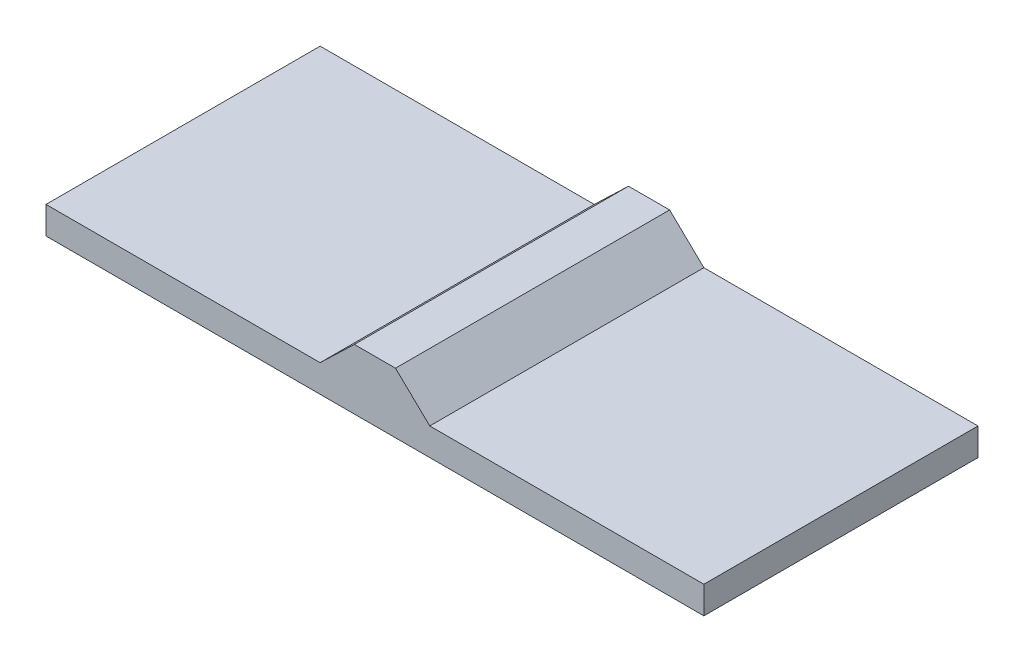
ISO-10303-21;
HEADER;
FILE_DESCRIPTION(('STEP AP214'),'2;1');
FILE_NAME('part.step','',(''),(''),'','','');
FILE_SCHEMA(('AUTOMOTIVE_DESIGN { 1 0 10303 214 1 1 1 1 }'));
ENDSEC;
DATA;
#1=APPLICATION_CONTEXT('core data for automotive mechanical design processes');
#2=APPLICATION_PROTOCOL_DEFINITION('international standard','automotive_design',2000,#1);
#3=PRODUCT_CONTEXT('',#1,'mechanical');
#4=PRODUCT('Part','Part','',(#3));
#5=PRODUCT_RELATED_PRODUCT_CATEGORY('part','',(#4));
#6=PRODUCT_DEFINITION_FORMATION('','',#4);
#7=PRODUCT_DEFINITION_CONTEXT('part definition',#1,'design');
#8=PRODUCT_DEFINITION('design','',#6,#7);
#9=PRODUCT_DEFINITION_SHAPE('','',#8);
#10=(LENGTH_UNIT() NAMED_UNIT(*) SI_UNIT(.MILLI.,.METRE.));
#11=(NAMED_UNIT(*) PLANE_ANGLE_UNIT() SI_UNIT($,.RADIAN.));
#12=(NAMED_UNIT(*) SI_UNIT($,.STERADIAN.) SOLID_ANGLE_UNIT());
#13=UNCERTAINTY_MEASURE_WITH_UNIT(LENGTH_MEASURE(1.E-05),#10,'distance_accuracy_value','');
#14=(GEOMETRIC_REPRESENTATION_CONTEXT(3) GLOBAL_UNCERTAINTY_ASSIGNED_CONTEXT((#13)) GLOBAL_UNIT_ASSIGNED_CONTEXT((#10,
#11,#12)) REPRESENTATION_CONTEXT('',''));
#15=CARTESIAN_POINT('',(0.,0.,0.));
#16=DIRECTION('',(0.,0.,1.));
#17=DIRECTION('',(1.,0.,0.));
#18=AXIS2_PLACEMENT_3D('',#15,#16,#17);
#19=CARTESIAN_POINT('',(0.,150.,0.));
#20=DIRECTION('',(0.,1.,0.));
#21=DIRECTION('',(0.,0.,1.));
#22=AXIS2_PLACEMENT_3D('',#19,#20,#21);
#23=PLANE('',#22);
#24=DIRECTION('',(-1.,0.,0.));
#25=VECTOR('',#24,1.);
#26=CARTESIAN_POINT('',(1800.,150.,-750.));
#27=LINE('',#26,#25);
#28=CARTESIAN_POINT('',(1800.,150.,-750.));
#29=VERTEX_POINT('',#28);
#30=CARTESIAN_POINT('',(300.,150.,-750.));
#31=VERTEX_POINT('',#30);
#32=EDGE_CURVE('E135',#29,#31,#27,.T.);
#33=ORIENTED_EDGE('',*,*,#32,.T.);
#34=DIRECTION('',(0.,0.,1.));
#35=VECTOR('',#34,1.);
#36=CARTESIAN_POINT('',(300.,150.,-750.));
#37=LINE('',#36,#35);
#38=CARTESIAN_POINT('',(300.,150.,750.));
#39=VERTEX_POINT('',#38);
#40=EDGE_CURVE('E128',#31,#39,#37,.T.);
#41=ORIENTED_EDGE('',*,*,#40,.T.);
#42=DIRECTION('',(1.,0.,0.));
#43=VECTOR('',#42,1.);
#44=CARTESIAN_POINT('',(1800.,150.,750.));
#45=LINE('',#44,#43);
#46=CARTESIAN_POINT('',(1800.,150.,750.));
#47=VERTEX_POINT('',#46);
#48=EDGE_CURVE('E176',#39,#47,#45,.T.);
#49=ORIENTED_EDGE('',*,*,#48,.T.);
#50=DIRECTION('',(0.,0.,-1.));
#51=VECTOR('',#50,1.);
#52=CARTESIAN_POINT('',(1800.,150.,750.));
#53=LINE('',#52,#51);
#54=EDGE_CURVE('E136',#47,#29,#53,.T.);
#55=ORIENTED_EDGE('',*,*,#54,.T.);
#56=EDGE_LOOP('',(#33,#41,#49,#55));
#57=FACE_BOUND('',#56,.T.);
#58=ADVANCED_FACE('F39',(#57),#23,.T.);
#59=CARTESIAN_POINT('',(-1800.,150.,750.));
#60=DIRECTION('',(1.,0.,0.));
#61=DIRECTION('',(0.,0.,-1.));
#62=AXIS2_PLACEMENT_3D('',#59,#60,#61);
#63=PLANE('',#62);
#64=DIRECTION('',(0.,0.,1.));
#65=VECTOR('',#64,1.);
#66=CARTESIAN_POINT('',(-1800.,0.,750.));
#67=LINE('',#66,#65);
#68=CARTESIAN_POINT('',(-1800.,0.,-750.));
#69=VERTEX_POINT('',#68);
#70=CARTESIAN_POINT('',(-1800.,0.,750.));
#71=VERTEX_POINT('',#70);
#72=EDGE_CURVE('E144',#69,#71,#67,.T.);
#73=ORIENTED_EDGE('',*,*,#72,.T.);
#74=DIRECTION('',(0.,-1.,0.));
#75=VECTOR('',#74,1.);
#76=CARTESIAN_POINT('',(-1800.,150.,750.));
#77=LINE('',#76,#75);
#78=CARTESIAN_POINT('',(-1800.,150.,750.));
#79=VERTEX_POINT('',#78);
#80=EDGE_CURVE('E11',#79,#71,#77,.T.);
#81=ORIENTED_EDGE('',*,*,#80,.F.);
#82=DIRECTION('',(0.,0.,1.));
#83=VECTOR('',#82,1.);
#84=CARTESIAN_POINT('',(-1800.,150.,750.));
#85=LINE('',#84,#83);
#86=CARTESIAN_POINT('',(-1800.,150.,-750.));
#87=VERTEX_POINT('',#86);
#88=EDGE_CURVE('E156',#87,#79,#85,.T.);
#89=ORIENTED_EDGE('',*,*,#88,.F.);
#90=DIRECTION('',(0.,-1.,0.));
#91=VECTOR('',#90,1.);
#92=CARTESIAN_POINT('',(-1800.,150.,-750.));
#93=LINE('',#92,#91);
#94=EDGE_CURVE('E132',#87,#69,#93,.T.);
#95=ORIENTED_EDGE('',*,*,#94,.T.);
#96=EDGE_LOOP('',(#73,#81,#89,#95));
#97=FACE_BOUND('',#96,.T.);
#98=ADVANCED_FACE('F41',(#97),#63,.F.);
#99=CARTESIAN_POINT('',(1800.,150.,750.));
#100=DIRECTION('',(0.,0.,-1.));
#101=DIRECTION('',(-1.,0.,0.));
#102=AXIS2_PLACEMENT_3D('',#99,#100,#101);
#103=PLANE('',#102);
#104=DIRECTION('',(1.,0.,0.));
#105=VECTOR('',#104,1.);
#106=CARTESIAN_POINT('',(1800.,0.,750.));
#107=LINE('',#106,#105);
#108=CARTESIAN_POINT('',(1800.,0.,750.));
#109=VERTEX_POINT('',#108);
#110=EDGE_CURVE('E148',#71,#109,#107,.T.);
#111=ORIENTED_EDGE('',*,*,#110,.T.);
#112=DIRECTION('',(0.,-1.,0.));
#113=VECTOR('',#112,1.);
#114=CARTESIAN_POINT('',(1800.,150.,750.));
#115=LINE('',#114,#113);
#116=EDGE_CURVE('E48',#47,#109,#115,.T.);
#117=ORIENTED_EDGE('',*,*,#116,.F.);
#118=ORIENTED_EDGE('',*,*,#48,.F.);
#119=DIRECTION('',(-0.721387321030952,0.692531828189714,0.));
#120=VECTOR('',#119,1.);
#121=CARTESIAN_POINT('',(112.5,330.,750.));
#122=LINE('',#121,#120);
#123=CARTESIAN_POINT('',(112.5,330.,750.));
#124=VERTEX_POINT('',#123);
#125=EDGE_CURVE('E55',#39,#124,#122,.T.);
#126=ORIENTED_EDGE('',*,*,#125,.T.);
#127=DIRECTION('',(-1.,0.,0.));
#128=VECTOR('',#127,1.);
#129=CARTESIAN_POINT('',(-112.5,330.,750.));
#130=LINE('',#129,#128);
#131=CARTESIAN_POINT('',(-112.5,330.,750.));
#132=VERTEX_POINT('',#131);
#133=EDGE_CURVE('E124',#124,#132,#130,.T.);
#134=ORIENTED_EDGE('',*,*,#133,.T.);
#135=DIRECTION('',(-0.721387321030952,-0.692531828189713,0.));
#136=VECTOR('',#135,1.);
#137=CARTESIAN_POINT('',(-300.,150.,750.));
#138=LINE('',#137,#136);
#139=CARTESIAN_POINT('',(-300.,150.,750.));
#140=VERTEX_POINT('',#139);
#141=EDGE_CURVE('E193',#132,#140,#138,.T.);
#142=ORIENTED_EDGE('',*,*,#141,.T.);
#143=EDGE_CURVE('E93',#79,#140,#45,.T.);
#144=ORIENTED_EDGE('',*,*,#143,.F.);
#145=ORIENTED_EDGE('',*,*,#80,.T.);
#146=EDGE_LOOP('',(#111,#117,#118,#126,#134,#142,#144,#145));
#147=FACE_BOUND('',#146,.T.);
#148=ADVANCED_FACE('F206',(#147),#103,.F.);
#149=CARTESIAN_POINT('',(1800.,150.,750.));
#150=DIRECTION('',(-1.,0.,0.));
#151=DIRECTION('',(0.,0.,1.));
#152=AXIS2_PLACEMENT_3D('',#149,#150,#151);
#153=PLANE('',#152);
#154=DIRECTION('',(0.,0.,-1.));
#155=VECTOR('',#154,1.);
#156=CARTESIAN_POINT('',(1800.,0.,750.));
#157=LINE('',#156,#155);
#158=CARTESIAN_POINT('',(1800.,0.,-750.));
#159=VERTEX_POINT('',#158);
#160=EDGE_CURVE('E151',#109,#159,#157,.T.);
#161=ORIENTED_EDGE('',*,*,#160,.T.);
#162=DIRECTION('',(0.,-1.,0.));
#163=VECTOR('',#162,1.);
#164=CARTESIAN_POINT('',(1800.,150.,-750.));
#165=LINE('',#164,#163);
#166=EDGE_CURVE('E159',#29,#159,#165,.T.);
#167=ORIENTED_EDGE('',*,*,#166,.F.);
#168=ORIENTED_EDGE('',*,*,#54,.F.);
#169=ORIENTED_EDGE('',*,*,#116,.T.);
#170=EDGE_LOOP('',(#161,#167,#168,#169));
#171=FACE_BOUND('',#170,.T.);
#172=ADVANCED_FACE('F167',(#171),#153,.F.);
#173=CARTESIAN_POINT('',(1800.,150.,-750.));
#174=DIRECTION('',(0.,0.,1.));
#175=DIRECTION('',(1.,0.,0.));
#176=AXIS2_PLACEMENT_3D('',#173,#174,#175);
#177=PLANE('',#176);
#178=DIRECTION('',(-1.,0.,0.));
#179=VECTOR('',#178,1.);
#180=CARTESIAN_POINT('',(1800.,0.,-750.));
#181=LINE('',#180,#179);
#182=EDGE_CURVE('E86',#159,#69,#181,.T.);
#183=ORIENTED_EDGE('',*,*,#182,.T.);
#184=ORIENTED_EDGE('',*,*,#94,.F.);
#185=CARTESIAN_POINT('',(-300.,150.,-750.));
#186=VERTEX_POINT('',#185);
#187=EDGE_CURVE('E64',#186,#87,#27,.T.);
#188=ORIENTED_EDGE('',*,*,#187,.F.);
#189=DIRECTION('',(-0.721387321030952,-0.692531828189713,0.));
#190=VECTOR('',#189,1.);
#191=CARTESIAN_POINT('',(-300.,150.,-750.));
#192=LINE('',#191,#190);
#193=CARTESIAN_POINT('',(-112.5,330.,-750.));
#194=VERTEX_POINT('',#193);
#195=EDGE_CURVE('E115',#194,#186,#192,.T.);
#196=ORIENTED_EDGE('',*,*,#195,.F.);
#197=DIRECTION('',(-1.,0.,0.));
#198=VECTOR('',#197,1.);
#199=CARTESIAN_POINT('',(-112.5,330.,-750.));
#200=LINE('',#199,#198);
#201=CARTESIAN_POINT('',(112.5,330.,-750.));
#202=VERTEX_POINT('',#201);
#203=EDGE_CURVE('E129',#202,#194,#200,.T.);
#204=ORIENTED_EDGE('',*,*,#203,.F.);
#205=DIRECTION('',(-0.721387321030952,0.692531828189714,0.));
#206=VECTOR('',#205,1.);
#207=CARTESIAN_POINT('',(112.5,330.,-750.));
#208=LINE('',#207,#206);
#209=EDGE_CURVE('E123',#31,#202,#208,.T.);
#210=ORIENTED_EDGE('',*,*,#209,.F.);
#211=ORIENTED_EDGE('',*,*,#32,.F.);
#212=ORIENTED_EDGE('',*,*,#166,.T.);
#213=EDGE_LOOP('',(#183,#184,#188,#196,#204,#210,#211,#212));
#214=FACE_BOUND('',#213,.T.);
#215=ADVANCED_FACE('F131',(#214),#177,.F.);
#216=DIRECTION('',(0.,0.,1.));
#217=VECTOR('',#216,1.);
#218=CARTESIAN_POINT('',(-300.,150.,-750.));
#219=LINE('',#218,#217);
#220=EDGE_CURVE('E118',#186,#140,#219,.T.);
#221=ORIENTED_EDGE('',*,*,#220,.F.);
#222=ORIENTED_EDGE('',*,*,#187,.T.);
#223=ORIENTED_EDGE('',*,*,#88,.T.);
#224=ORIENTED_EDGE('',*,*,#143,.T.);
#225=EDGE_LOOP('',(#221,#222,#223,#224));
#226=FACE_BOUND('',#225,.T.);
#227=ADVANCED_FACE('F126',(#226),#23,.T.);
#228=CARTESIAN_POINT('',(0.,0.,0.));
#229=DIRECTION('',(0.,1.,0.));
#230=DIRECTION('',(0.,0.,1.));
#231=AXIS2_PLACEMENT_3D('',#228,#229,#230);
#232=PLANE('',#231);
#233=ORIENTED_EDGE('',*,*,#72,.F.);
#234=ORIENTED_EDGE('',*,*,#182,.F.);
#235=ORIENTED_EDGE('',*,*,#160,.F.);
#236=ORIENTED_EDGE('',*,*,#110,.F.);
#237=EDGE_LOOP('',(#233,#234,#235,#236));
#238=FACE_BOUND('',#237,.T.);
#239=ADVANCED_FACE('F172',(#238),#232,.F.);
#240=CARTESIAN_POINT('',(-300.,150.,-750.));
#241=DIRECTION('',(-0.692531828189713,0.721387321030952,0.));
#242=DIRECTION('',(-0.721387321030952,-0.692531828189713,0.));
#243=AXIS2_PLACEMENT_3D('',#240,#241,#242);
#244=PLANE('',#243);
#245=ORIENTED_EDGE('',*,*,#141,.F.);
#246=DIRECTION('',(0.,0.,1.));
#247=VECTOR('',#246,1.);
#248=CARTESIAN_POINT('',(-112.5,330.,-750.));
#249=LINE('',#248,#247);
#250=EDGE_CURVE('E119',#194,#132,#249,.T.);
#251=ORIENTED_EDGE('',*,*,#250,.F.);
#252=ORIENTED_EDGE('',*,*,#195,.T.);
#253=ORIENTED_EDGE('',*,*,#220,.T.);
#254=EDGE_LOOP('',(#245,#251,#252,#253));
#255=FACE_BOUND('',#254,.T.);
#256=ADVANCED_FACE('F117',(#255),#244,.T.);
#257=CARTESIAN_POINT('',(-112.5,330.,-750.));
#258=DIRECTION('',(0.,1.,0.));
#259=DIRECTION('',(0.,0.,1.));
#260=AXIS2_PLACEMENT_3D('',#257,#258,#259);
#261=PLANE('',#260);
#262=ORIENTED_EDGE('',*,*,#133,.F.);
#263=DIRECTION('',(0.,0.,1.));
#264=VECTOR('',#263,1.);
#265=CARTESIAN_POINT('',(112.5,330.,-750.));
#266=LINE('',#265,#264);
#267=EDGE_CURVE('E183',#202,#124,#266,.T.);
#268=ORIENTED_EDGE('',*,*,#267,.F.);
#269=ORIENTED_EDGE('',*,*,#203,.T.);
#270=ORIENTED_EDGE('',*,*,#250,.T.);
#271=EDGE_LOOP('',(#262,#268,#269,#270));
#272=FACE_BOUND('',#271,.T.);
#273=ADVANCED_FACE('F205',(#272),#261,.T.);
#274=CARTESIAN_POINT('',(112.5,330.,-750.));
#275=DIRECTION('',(0.692531828189713,0.721387321030951,0.));
#276=DIRECTION('',(-0.721387321030952,0.692531828189714,0.));
#277=AXIS2_PLACEMENT_3D('',#274,#275,#276);
#278=PLANE('',#277);
#279=ORIENTED_EDGE('',*,*,#125,.F.);
#280=ORIENTED_EDGE('',*,*,#40,.F.);
#281=ORIENTED_EDGE('',*,*,#209,.T.);
#282=ORIENTED_EDGE('',*,*,#267,.T.);
#283=EDGE_LOOP('',(#279,#280,#281,#282));
#284=FACE_BOUND('',#283,.T.);
#285=ADVANCED_FACE('F201',(#284),#278,.T.);
#286=CLOSED_SHELL('',(#58,#98,#148,#172,#215,#227,#239,#256,#273,#285));
#287=MANIFOLD_SOLID_BREP('B2',#286);
#288=ADVANCED_BREP_SHAPE_REPRESENTATION('',(#18,#287),#14);
#289=SHAPE_DEFINITION_REPRESENTATION(#9,#288);
ENDSEC;
END-ISO-10303-21;
